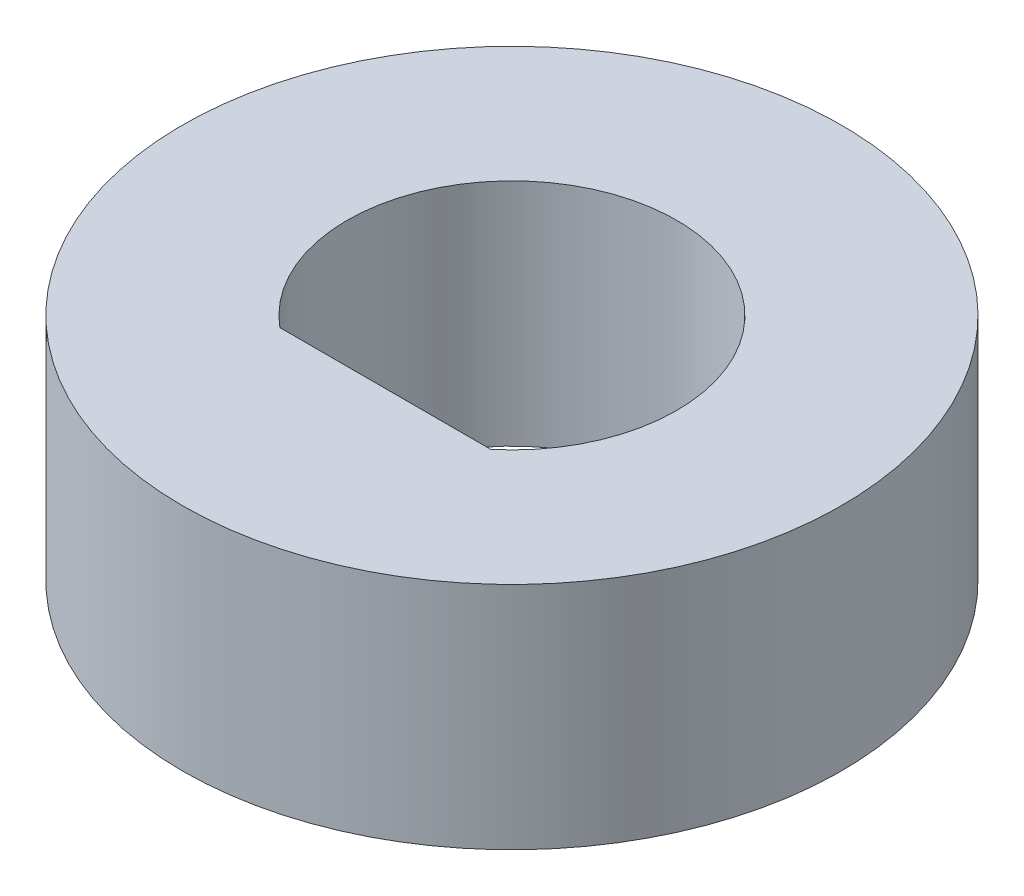
ISO-10303-21;
HEADER;
FILE_DESCRIPTION(('STEP AP214'),'2;1');
FILE_NAME('part.step','',(''),(''),'','','');
FILE_SCHEMA(('AUTOMOTIVE_DESIGN { 1 0 10303 214 1 1 1 1 }'));
ENDSEC;
DATA;
#1=APPLICATION_CONTEXT('core data for automotive mechanical design processes');
#2=APPLICATION_PROTOCOL_DEFINITION('international standard','automotive_design',2000,#1);
#3=PRODUCT_CONTEXT('',#1,'mechanical');
#4=PRODUCT('Part','Part','',(#3));
#5=PRODUCT_RELATED_PRODUCT_CATEGORY('part','',(#4));
#6=PRODUCT_DEFINITION_FORMATION('','',#4);
#7=PRODUCT_DEFINITION_CONTEXT('part definition',#1,'design');
#8=PRODUCT_DEFINITION('design','',#6,#7);
#9=PRODUCT_DEFINITION_SHAPE('','',#8);
#10=(LENGTH_UNIT() NAMED_UNIT(*) SI_UNIT(.MILLI.,.METRE.));
#11=(NAMED_UNIT(*) PLANE_ANGLE_UNIT() SI_UNIT($,.RADIAN.));
#12=(NAMED_UNIT(*) SI_UNIT($,.STERADIAN.) SOLID_ANGLE_UNIT());
#13=UNCERTAINTY_MEASURE_WITH_UNIT(LENGTH_MEASURE(1.E-05),#10,'distance_accuracy_value','');
#14=(GEOMETRIC_REPRESENTATION_CONTEXT(3) GLOBAL_UNCERTAINTY_ASSIGNED_CONTEXT((#13)) GLOBAL_UNIT_ASSIGNED_CONTEXT((#10,
#11,#12)) REPRESENTATION_CONTEXT('',''));
#15=CARTESIAN_POINT('',(0.,0.,0.));
#16=DIRECTION('',(0.,0.,1.));
#17=DIRECTION('',(1.,0.,0.));
#18=AXIS2_PLACEMENT_3D('',#15,#16,#17);
#19=CARTESIAN_POINT('',(0.,76.2,2.43959033446192));
#20=DIRECTION('',(0.,0.,-1.));
#21=DIRECTION('',(-1.,0.,0.));
#22=AXIS2_PLACEMENT_3D('',#19,#20,#21);
#23=PLANE('',#22);
#24=DIRECTION('',(0.,-1.,0.));
#25=VECTOR('',#24,1.);
#26=CARTESIAN_POINT('',(-2.032,76.2,2.43959033446192));
#27=LINE('',#26,#25);
#28=CARTESIAN_POINT('',(-2.032,4.42722000000004,2.43959033446192));
#29=VERTEX_POINT('',#28);
#30=CARTESIAN_POINT('',(-2.032,0.,2.43959033446192));
#31=VERTEX_POINT('',#30);
#32=EDGE_CURVE('E11',#29,#31,#27,.T.);
#33=ORIENTED_EDGE('',*,*,#32,.F.);
#34=DIRECTION('',(1.,0.,0.));
#35=VECTOR('',#34,1.);
#36=CARTESIAN_POINT('',(0.,4.42722000000001,2.43959033446192));
#37=LINE('',#36,#35);
#38=CARTESIAN_POINT('',(2.032,4.42722000000001,2.43959033446192));
#39=VERTEX_POINT('',#38);
#40=EDGE_CURVE('E55',#29,#39,#37,.T.);
#41=ORIENTED_EDGE('',*,*,#40,.T.);
#42=DIRECTION('',(0.,-1.,0.));
#43=VECTOR('',#42,1.);
#44=CARTESIAN_POINT('',(2.032,76.2,2.43959033446192));
#45=LINE('',#44,#43);
#46=CARTESIAN_POINT('',(2.032,0.,2.43959033446192));
#47=VERTEX_POINT('',#46);
#48=EDGE_CURVE('E49',#39,#47,#45,.T.);
#49=ORIENTED_EDGE('',*,*,#48,.T.);
#50=DIRECTION('',(1.,0.,0.));
#51=VECTOR('',#50,1.);
#52=CARTESIAN_POINT('',(0.,0.,2.43959033446192));
#53=LINE('',#52,#51);
#54=EDGE_CURVE('E75',#31,#47,#53,.T.);
#55=ORIENTED_EDGE('',*,*,#54,.F.);
#56=EDGE_LOOP('',(#33,#41,#49,#55));
#57=FACE_BOUND('',#56,.T.);
#58=ADVANCED_FACE('F41',(#57),#23,.T.);
#59=CARTESIAN_POINT('',(0.,76.2,0.));
#60=DIRECTION('',(0.,-1.,0.));
#61=DIRECTION('',(0.,0.,-1.));
#62=AXIS2_PLACEMENT_3D('',#59,#60,#61);
#63=CYLINDRICAL_SURFACE('',#62,3.175);
#64=ORIENTED_EDGE('',*,*,#48,.F.);
#65=CARTESIAN_POINT('',(0.,4.42722000000001,0.));
#66=DIRECTION('',(0.,1.,0.));
#67=DIRECTION('',(0.,0.,1.));
#68=AXIS2_PLACEMENT_3D('',#65,#66,#67);
#69=CIRCLE('',#68,3.175);
#70=EDGE_CURVE('E66',#39,#29,#69,.T.);
#71=ORIENTED_EDGE('',*,*,#70,.T.);
#72=ORIENTED_EDGE('',*,*,#32,.T.);
#73=CARTESIAN_POINT('',(0.,0.,0.));
#74=DIRECTION('',(0.,1.,0.));
#75=DIRECTION('',(0.,0.,1.));
#76=AXIS2_PLACEMENT_3D('',#73,#74,#75);
#77=CIRCLE('',#76,3.175);
#78=EDGE_CURVE('E80',#47,#31,#77,.T.);
#79=ORIENTED_EDGE('',*,*,#78,.F.);
#80=EDGE_LOOP('',(#64,#71,#72,#79));
#81=FACE_BOUND('',#80,.T.);
#82=ADVANCED_FACE('F78',(#81),#63,.F.);
#83=CARTESIAN_POINT('',(0.,76.2,0.));
#84=DIRECTION('',(0.,-1.,0.));
#85=DIRECTION('',(0.,0.,-1.));
#86=AXIS2_PLACEMENT_3D('',#83,#84,#85);
#87=CYLINDRICAL_SURFACE('',#86,6.35);
#88=CARTESIAN_POINT('',(0.,0.,0.));
#89=DIRECTION('',(0.,1.,0.));
#90=DIRECTION('',(0.,0.,1.));
#91=AXIS2_PLACEMENT_3D('',#88,#89,#90);
#92=CIRCLE('',#91,6.35);
#93=CARTESIAN_POINT('',(0.,0.,6.35));
#94=VERTEX_POINT('',#93);
#95=EDGE_CURVE('E82',#94,#94,#92,.T.);
#96=ORIENTED_EDGE('',*,*,#95,.T.);
#97=EDGE_LOOP('',(#96));
#98=FACE_BOUND('',#97,.T.);
#99=CARTESIAN_POINT('',(0.,4.42722000000001,0.));
#100=DIRECTION('',(0.,1.,0.));
#101=DIRECTION('',(0.,0.,1.));
#102=AXIS2_PLACEMENT_3D('',#99,#100,#101);
#103=CIRCLE('',#102,6.35);
#104=CARTESIAN_POINT('',(0.,4.42722000000001,6.35));
#105=VERTEX_POINT('',#104);
#106=EDGE_CURVE('E72',#105,#105,#103,.T.);
#107=ORIENTED_EDGE('',*,*,#106,.F.);
#108=EDGE_LOOP('',(#107));
#109=FACE_BOUND('',#108,.T.);
#110=ADVANCED_FACE('F95',(#98,#109),#87,.T.);
#111=CARTESIAN_POINT('',(0.,0.,0.));
#112=DIRECTION('',(0.,1.,0.));
#113=DIRECTION('',(0.,0.,1.));
#114=AXIS2_PLACEMENT_3D('',#111,#112,#113);
#115=PLANE('',#114);
#116=ORIENTED_EDGE('',*,*,#54,.T.);
#117=ORIENTED_EDGE('',*,*,#78,.T.);
#118=EDGE_LOOP('',(#116,#117));
#119=FACE_BOUND('',#118,.T.);
#120=ORIENTED_EDGE('',*,*,#95,.F.);
#121=EDGE_LOOP('',(#120));
#122=FACE_BOUND('',#121,.T.);
#123=ADVANCED_FACE('F97',(#119,#122),#115,.F.);
#124=CARTESIAN_POINT('',(0.,4.42722000000001,0.));
#125=DIRECTION('',(0.,1.,0.));
#126=DIRECTION('',(0.,0.,1.));
#127=AXIS2_PLACEMENT_3D('',#124,#125,#126);
#128=PLANE('',#127);
#129=ORIENTED_EDGE('',*,*,#70,.F.);
#130=ORIENTED_EDGE('',*,*,#40,.F.);
#131=EDGE_LOOP('',(#129,#130));
#132=FACE_BOUND('',#131,.T.);
#133=ORIENTED_EDGE('',*,*,#106,.T.);
#134=EDGE_LOOP('',(#133));
#135=FACE_BOUND('',#134,.T.);
#136=ADVANCED_FACE('F67',(#132,#135),#128,.T.);
#137=CLOSED_SHELL('',(#58,#82,#110,#123,#136));
#138=MANIFOLD_SOLID_BREP('B2',#137);
#139=ADVANCED_BREP_SHAPE_REPRESENTATION('',(#18,#138),#14);
#140=SHAPE_DEFINITION_REPRESENTATION(#9,#139);
ENDSEC;
END-ISO-10303-21;
